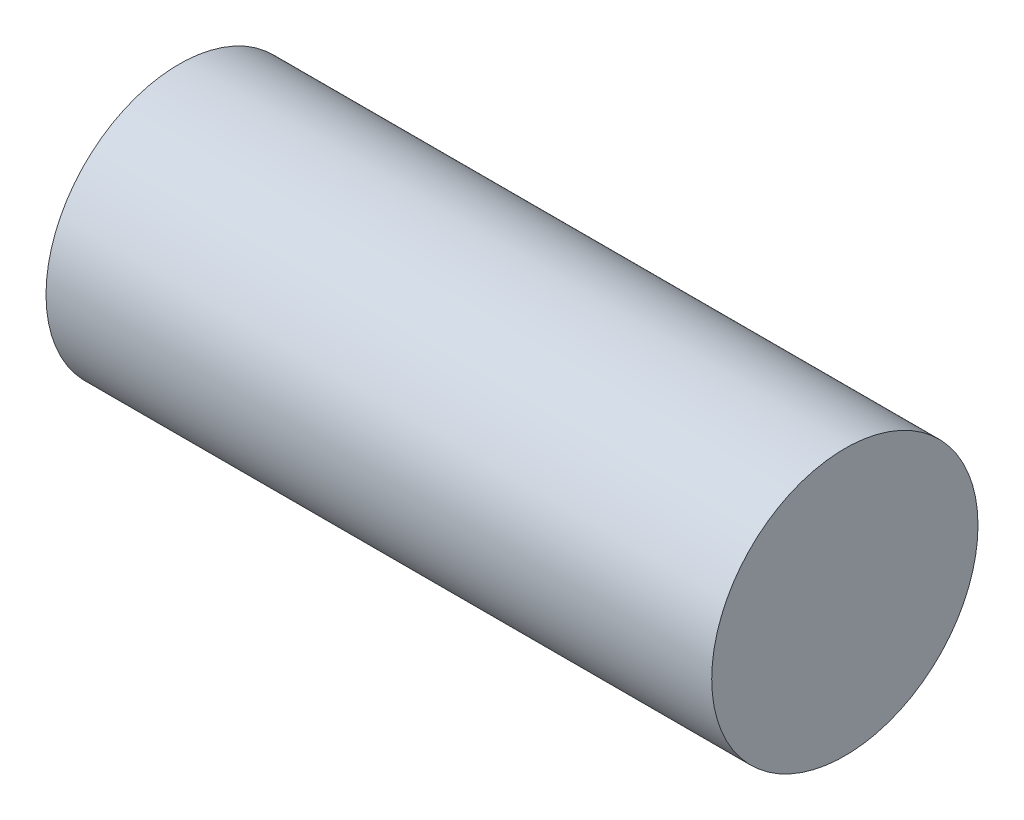
ISO-10303-21;
HEADER;
FILE_DESCRIPTION(('STEP AP214'),'2;1');
FILE_NAME('part.step','',(''),(''),'','','');
FILE_SCHEMA(('AUTOMOTIVE_DESIGN { 1 0 10303 214 1 1 1 1 }'));
ENDSEC;
DATA;
#1=APPLICATION_CONTEXT('core data for automotive mechanical design processes');
#2=APPLICATION_PROTOCOL_DEFINITION('international standard','automotive_design',2000,#1);
#3=PRODUCT_CONTEXT('',#1,'mechanical');
#4=PRODUCT('Part','Part','',(#3));
#5=PRODUCT_RELATED_PRODUCT_CATEGORY('part','',(#4));
#6=PRODUCT_DEFINITION_FORMATION('','',#4);
#7=PRODUCT_DEFINITION_CONTEXT('part definition',#1,'design');
#8=PRODUCT_DEFINITION('design','',#6,#7);
#9=PRODUCT_DEFINITION_SHAPE('','',#8);
#10=(LENGTH_UNIT() NAMED_UNIT(*) SI_UNIT(.MILLI.,.METRE.));
#11=(NAMED_UNIT(*) PLANE_ANGLE_UNIT() SI_UNIT($,.RADIAN.));
#12=(NAMED_UNIT(*) SI_UNIT($,.STERADIAN.) SOLID_ANGLE_UNIT());
#13=UNCERTAINTY_MEASURE_WITH_UNIT(LENGTH_MEASURE(1.E-05),#10,'distance_accuracy_value','');
#14=(GEOMETRIC_REPRESENTATION_CONTEXT(3) GLOBAL_UNCERTAINTY_ASSIGNED_CONTEXT((#13)) GLOBAL_UNIT_ASSIGNED_CONTEXT((#10,
#11,#12)) REPRESENTATION_CONTEXT('',''));
#15=CARTESIAN_POINT('',(0.,0.,0.));
#16=DIRECTION('',(0.,0.,1.));
#17=DIRECTION('',(1.,0.,0.));
#18=AXIS2_PLACEMENT_3D('',#15,#16,#17);
#19=CARTESIAN_POINT('',(1.,0.,0.));
#20=DIRECTION('',(-1.,0.,0.));
#21=DIRECTION('',(0.,0.,1.));
#22=AXIS2_PLACEMENT_3D('',#19,#20,#21);
#23=CYLINDRICAL_SURFACE('',#22,0.199999999999999);
#24=CARTESIAN_POINT('',(1.,0.,0.));
#25=DIRECTION('',(1.,0.,0.));
#26=DIRECTION('',(0.,0.,-1.));
#27=AXIS2_PLACEMENT_3D('',#24,#25,#26);
#28=CIRCLE('',#27,0.199999999999999);
#29=CARTESIAN_POINT('',(1.,0.,-0.199999999999999));
#30=VERTEX_POINT('',#29);
#31=EDGE_CURVE('E10',#30,#30,#28,.T.);
#32=ORIENTED_EDGE('',*,*,#31,.F.);
#33=EDGE_LOOP('',(#32));
#34=FACE_BOUND('',#33,.T.);
#35=CARTESIAN_POINT('',(0.,0.,0.));
#36=DIRECTION('',(1.,0.,0.));
#37=DIRECTION('',(0.,0.,-1.));
#38=AXIS2_PLACEMENT_3D('',#35,#36,#37);
#39=CIRCLE('',#38,0.199999999999999);
#40=CARTESIAN_POINT('',(0.,0.,-0.199999999999999));
#41=VERTEX_POINT('',#40);
#42=EDGE_CURVE('E34',#41,#41,#39,.T.);
#43=ORIENTED_EDGE('',*,*,#42,.T.);
#44=EDGE_LOOP('',(#43));
#45=FACE_BOUND('',#44,.T.);
#46=ADVANCED_FACE('F31',(#34,#45),#23,.T.);
#47=CARTESIAN_POINT('',(1.,0.,0.));
#48=DIRECTION('',(1.,0.,0.));
#49=DIRECTION('',(0.,0.,-1.));
#50=AXIS2_PLACEMENT_3D('',#47,#48,#49);
#51=PLANE('',#50);
#52=ORIENTED_EDGE('',*,*,#31,.T.);
#53=EDGE_LOOP('',(#52));
#54=FACE_BOUND('',#53,.T.);
#55=ADVANCED_FACE('F46',(#54),#51,.T.);
#56=CARTESIAN_POINT('',(0.,0.,0.));
#57=DIRECTION('',(1.,0.,0.));
#58=DIRECTION('',(0.,0.,-1.));
#59=AXIS2_PLACEMENT_3D('',#56,#57,#58);
#60=PLANE('',#59);
#61=ORIENTED_EDGE('',*,*,#42,.F.);
#62=EDGE_LOOP('',(#61));
#63=FACE_BOUND('',#62,.T.);
#64=ADVANCED_FACE('F44',(#63),#60,.F.);
#65=CLOSED_SHELL('',(#46,#55,#64));
#66=MANIFOLD_SOLID_BREP('B2',#65);
#67=ADVANCED_BREP_SHAPE_REPRESENTATION('',(#18,#66),#14);
#68=SHAPE_DEFINITION_REPRESENTATION(#9,#67);
ENDSEC;
END-ISO-10303-21;
